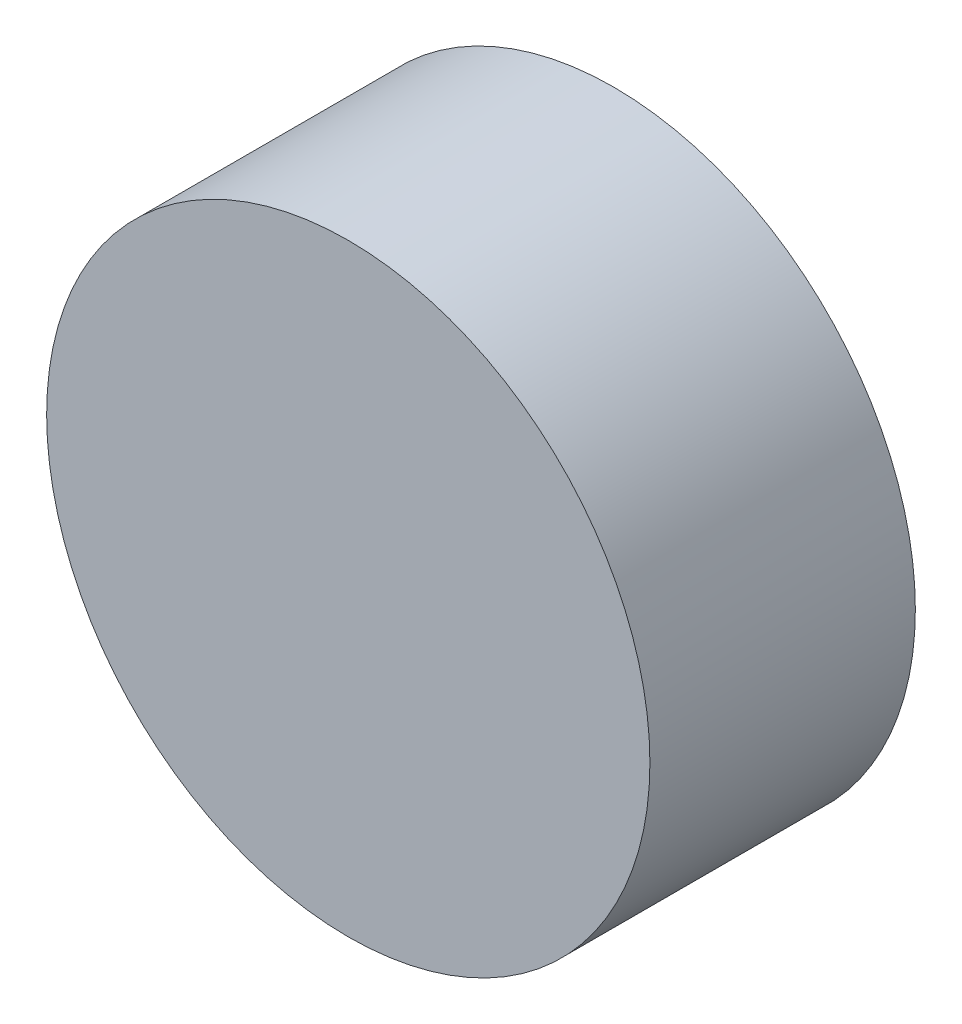
ISO-10303-21;
HEADER;
FILE_DESCRIPTION(('STEP AP214'),'2;1');
FILE_NAME('part.step','',(''),(''),'','','');
FILE_SCHEMA(('AUTOMOTIVE_DESIGN { 1 0 10303 214 1 1 1 1 }'));
ENDSEC;
DATA;
#1=APPLICATION_CONTEXT('core data for automotive mechanical design processes');
#2=APPLICATION_PROTOCOL_DEFINITION('international standard','automotive_design',2000,#1);
#3=PRODUCT_CONTEXT('',#1,'mechanical');
#4=PRODUCT('Part','Part','',(#3));
#5=PRODUCT_RELATED_PRODUCT_CATEGORY('part','',(#4));
#6=PRODUCT_DEFINITION_FORMATION('','',#4);
#7=PRODUCT_DEFINITION_CONTEXT('part definition',#1,'design');
#8=PRODUCT_DEFINITION('design','',#6,#7);
#9=PRODUCT_DEFINITION_SHAPE('','',#8);
#10=(LENGTH_UNIT() NAMED_UNIT(*) SI_UNIT(.MILLI.,.METRE.));
#11=(NAMED_UNIT(*) PLANE_ANGLE_UNIT() SI_UNIT($,.RADIAN.));
#12=(NAMED_UNIT(*) SI_UNIT($,.STERADIAN.) SOLID_ANGLE_UNIT());
#13=UNCERTAINTY_MEASURE_WITH_UNIT(LENGTH_MEASURE(1.E-05),#10,'distance_accuracy_value','');
#14=(GEOMETRIC_REPRESENTATION_CONTEXT(3) GLOBAL_UNCERTAINTY_ASSIGNED_CONTEXT((#13)) GLOBAL_UNIT_ASSIGNED_CONTEXT((#10,
#11,#12)) REPRESENTATION_CONTEXT('',''));
#15=CARTESIAN_POINT('',(0.,0.,0.));
#16=DIRECTION('',(0.,0.,1.));
#17=DIRECTION('',(1.,0.,0.));
#18=AXIS2_PLACEMENT_3D('',#15,#16,#17);
#19=CARTESIAN_POINT('',(0.,0.,11.));
#20=DIRECTION('',(0.,0.,-1.));
#21=DIRECTION('',(-1.,0.,0.));
#22=AXIS2_PLACEMENT_3D('',#19,#20,#21);
#23=CYLINDRICAL_SURFACE('',#22,12.5);
#24=CARTESIAN_POINT('',(0.,0.,11.));
#25=DIRECTION('',(0.,0.,1.));
#26=DIRECTION('',(1.,0.,0.));
#27=AXIS2_PLACEMENT_3D('',#24,#25,#26);
#28=CIRCLE('',#27,12.5);
#29=CARTESIAN_POINT('',(12.5,0.,11.));
#30=VERTEX_POINT('',#29);
#31=EDGE_CURVE('E10',#30,#30,#28,.T.);
#32=ORIENTED_EDGE('',*,*,#31,.F.);
#33=EDGE_LOOP('',(#32));
#34=FACE_BOUND('',#33,.T.);
#35=CARTESIAN_POINT('',(0.,0.,0.));
#36=DIRECTION('',(0.,0.,1.));
#37=DIRECTION('',(1.,0.,0.));
#38=AXIS2_PLACEMENT_3D('',#35,#36,#37);
#39=CIRCLE('',#38,12.5);
#40=CARTESIAN_POINT('',(12.5,0.,0.));
#41=VERTEX_POINT('',#40);
#42=EDGE_CURVE('E34',#41,#41,#39,.T.);
#43=ORIENTED_EDGE('',*,*,#42,.T.);
#44=EDGE_LOOP('',(#43));
#45=FACE_BOUND('',#44,.T.);
#46=ADVANCED_FACE('F31',(#34,#45),#23,.T.);
#47=CARTESIAN_POINT('',(0.,0.,11.));
#48=DIRECTION('',(0.,0.,1.));
#49=DIRECTION('',(1.,0.,0.));
#50=AXIS2_PLACEMENT_3D('',#47,#48,#49);
#51=PLANE('',#50);
#52=ORIENTED_EDGE('',*,*,#31,.T.);
#53=EDGE_LOOP('',(#52));
#54=FACE_BOUND('',#53,.T.);
#55=ADVANCED_FACE('F46',(#54),#51,.T.);
#56=CARTESIAN_POINT('',(0.,0.,0.));
#57=DIRECTION('',(0.,0.,1.));
#58=DIRECTION('',(1.,0.,0.));
#59=AXIS2_PLACEMENT_3D('',#56,#57,#58);
#60=PLANE('',#59);
#61=ORIENTED_EDGE('',*,*,#42,.F.);
#62=EDGE_LOOP('',(#61));
#63=FACE_BOUND('',#62,.T.);
#64=ADVANCED_FACE('F44',(#63),#60,.F.);
#65=CLOSED_SHELL('',(#46,#55,#64));
#66=MANIFOLD_SOLID_BREP('B2',#65);
#67=ADVANCED_BREP_SHAPE_REPRESENTATION('',(#18,#66),#14);
#68=SHAPE_DEFINITION_REPRESENTATION(#9,#67);
ENDSEC;
END-ISO-10303-21;
